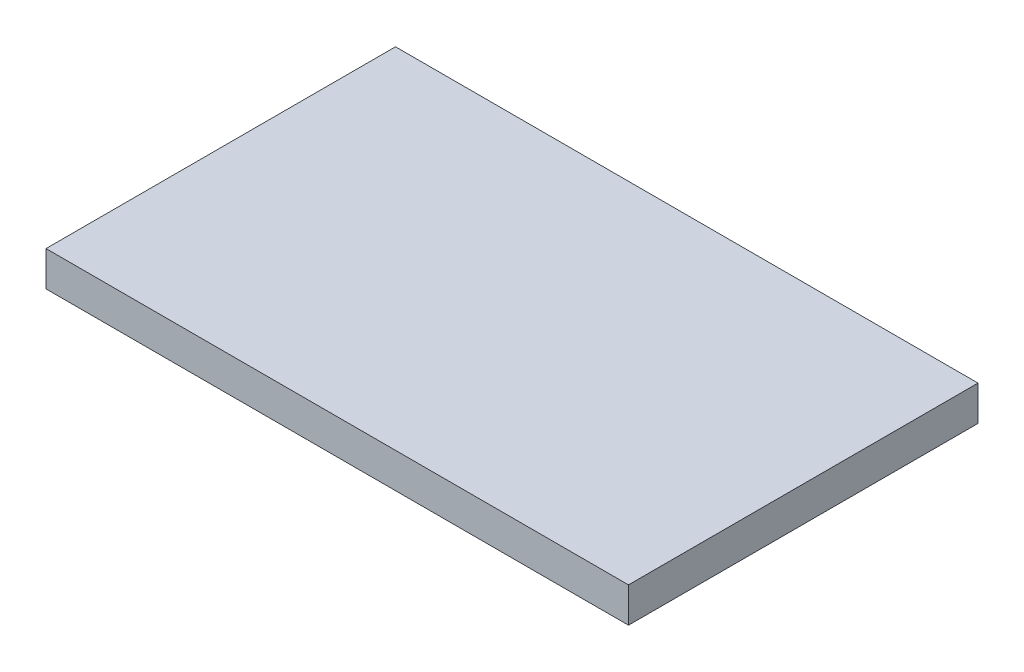
ISO-10303-21;
HEADER;
FILE_DESCRIPTION(('STEP AP214'),'2;1');
FILE_NAME('part.step','',(''),(''),'','','');
FILE_SCHEMA(('AUTOMOTIVE_DESIGN { 1 0 10303 214 1 1 1 1 }'));
ENDSEC;
DATA;
#1=APPLICATION_CONTEXT('core data for automotive mechanical design processes');
#2=APPLICATION_PROTOCOL_DEFINITION('international standard','automotive_design',2000,#1);
#3=PRODUCT_CONTEXT('',#1,'mechanical');
#4=PRODUCT('Part','Part','',(#3));
#5=PRODUCT_RELATED_PRODUCT_CATEGORY('part','',(#4));
#6=PRODUCT_DEFINITION_FORMATION('','',#4);
#7=PRODUCT_DEFINITION_CONTEXT('part definition',#1,'design');
#8=PRODUCT_DEFINITION('design','',#6,#7);
#9=PRODUCT_DEFINITION_SHAPE('','',#8);
#10=(LENGTH_UNIT() NAMED_UNIT(*) SI_UNIT(.MILLI.,.METRE.));
#11=(NAMED_UNIT(*) PLANE_ANGLE_UNIT() SI_UNIT($,.RADIAN.));
#12=(NAMED_UNIT(*) SI_UNIT($,.STERADIAN.) SOLID_ANGLE_UNIT());
#13=UNCERTAINTY_MEASURE_WITH_UNIT(LENGTH_MEASURE(1.E-05),#10,'distance_accuracy_value','');
#14=(GEOMETRIC_REPRESENTATION_CONTEXT(3) GLOBAL_UNCERTAINTY_ASSIGNED_CONTEXT((#13)) GLOBAL_UNIT_ASSIGNED_CONTEXT((#10,
#11,#12)) REPRESENTATION_CONTEXT('',''));
#15=CARTESIAN_POINT('',(0.,0.,0.));
#16=DIRECTION('',(0.,0.,1.));
#17=DIRECTION('',(1.,0.,0.));
#18=AXIS2_PLACEMENT_3D('',#15,#16,#17);
#19=CARTESIAN_POINT('',(25.,3.,15.));
#20=DIRECTION('',(-1.,0.,0.));
#21=DIRECTION('',(0.,0.,1.));
#22=AXIS2_PLACEMENT_3D('',#19,#20,#21);
#23=PLANE('',#22);
#24=DIRECTION('',(0.,0.,-1.));
#25=VECTOR('',#24,1.);
#26=CARTESIAN_POINT('',(25.,0.,15.));
#27=LINE('',#26,#25);
#28=CARTESIAN_POINT('',(25.,0.,15.));
#29=VERTEX_POINT('',#28);
#30=CARTESIAN_POINT('',(25.,0.,-15.));
#31=VERTEX_POINT('',#30);
#32=EDGE_CURVE('E113',#29,#31,#27,.T.);
#33=ORIENTED_EDGE('',*,*,#32,.T.);
#34=DIRECTION('',(0.,-1.,0.));
#35=VECTOR('',#34,1.);
#36=CARTESIAN_POINT('',(25.,3.,-15.));
#37=LINE('',#36,#35);
#38=CARTESIAN_POINT('',(25.,3.,-15.));
#39=VERTEX_POINT('',#38);
#40=EDGE_CURVE('E11',#39,#31,#37,.T.);
#41=ORIENTED_EDGE('',*,*,#40,.F.);
#42=DIRECTION('',(0.,0.,-1.));
#43=VECTOR('',#42,1.);
#44=CARTESIAN_POINT('',(25.,3.,15.));
#45=LINE('',#44,#43);
#46=CARTESIAN_POINT('',(25.,3.,15.));
#47=VERTEX_POINT('',#46);
#48=EDGE_CURVE('E97',#47,#39,#45,.T.);
#49=ORIENTED_EDGE('',*,*,#48,.F.);
#50=DIRECTION('',(0.,-1.,0.));
#51=VECTOR('',#50,1.);
#52=CARTESIAN_POINT('',(25.,3.,15.));
#53=LINE('',#52,#51);
#54=EDGE_CURVE('E109',#47,#29,#53,.T.);
#55=ORIENTED_EDGE('',*,*,#54,.T.);
#56=EDGE_LOOP('',(#33,#41,#49,#55));
#57=FACE_BOUND('',#56,.T.);
#58=ADVANCED_FACE('F45',(#57),#23,.F.);
#59=CARTESIAN_POINT('',(-25.,3.,-15.));
#60=DIRECTION('',(0.,0.,1.));
#61=DIRECTION('',(1.,0.,0.));
#62=AXIS2_PLACEMENT_3D('',#59,#60,#61);
#63=PLANE('',#62);
#64=DIRECTION('',(-1.,0.,0.));
#65=VECTOR('',#64,1.);
#66=CARTESIAN_POINT('',(-25.,0.,-15.));
#67=LINE('',#66,#65);
#68=CARTESIAN_POINT('',(-25.,0.,-15.));
#69=VERTEX_POINT('',#68);
#70=EDGE_CURVE('E102',#31,#69,#67,.T.);
#71=ORIENTED_EDGE('',*,*,#70,.T.);
#72=DIRECTION('',(0.,-1.,0.));
#73=VECTOR('',#72,1.);
#74=CARTESIAN_POINT('',(-25.,3.,-15.));
#75=LINE('',#74,#73);
#76=CARTESIAN_POINT('',(-25.,3.,-15.));
#77=VERTEX_POINT('',#76);
#78=EDGE_CURVE('E54',#77,#69,#75,.T.);
#79=ORIENTED_EDGE('',*,*,#78,.F.);
#80=DIRECTION('',(-1.,0.,0.));
#81=VECTOR('',#80,1.);
#82=CARTESIAN_POINT('',(-25.,3.,-15.));
#83=LINE('',#82,#81);
#84=EDGE_CURVE('E92',#39,#77,#83,.T.);
#85=ORIENTED_EDGE('',*,*,#84,.F.);
#86=ORIENTED_EDGE('',*,*,#40,.T.);
#87=EDGE_LOOP('',(#71,#79,#85,#86));
#88=FACE_BOUND('',#87,.T.);
#89=ADVANCED_FACE('F101',(#88),#63,.F.);
#90=CARTESIAN_POINT('',(-25.,3.,15.));
#91=DIRECTION('',(1.,0.,0.));
#92=DIRECTION('',(0.,0.,-1.));
#93=AXIS2_PLACEMENT_3D('',#90,#91,#92);
#94=PLANE('',#93);
#95=DIRECTION('',(0.,0.,1.));
#96=VECTOR('',#95,1.);
#97=CARTESIAN_POINT('',(-25.,0.,15.));
#98=LINE('',#97,#96);
#99=CARTESIAN_POINT('',(-25.,0.,15.));
#100=VERTEX_POINT('',#99);
#101=EDGE_CURVE('E79',#69,#100,#98,.T.);
#102=ORIENTED_EDGE('',*,*,#101,.T.);
#103=DIRECTION('',(0.,-1.,0.));
#104=VECTOR('',#103,1.);
#105=CARTESIAN_POINT('',(-25.,3.,15.));
#106=LINE('',#105,#104);
#107=CARTESIAN_POINT('',(-25.,3.,15.));
#108=VERTEX_POINT('',#107);
#109=EDGE_CURVE('E104',#108,#100,#106,.T.);
#110=ORIENTED_EDGE('',*,*,#109,.F.);
#111=DIRECTION('',(0.,0.,1.));
#112=VECTOR('',#111,1.);
#113=CARTESIAN_POINT('',(-25.,3.,15.));
#114=LINE('',#113,#112);
#115=EDGE_CURVE('E95',#77,#108,#114,.T.);
#116=ORIENTED_EDGE('',*,*,#115,.F.);
#117=ORIENTED_EDGE('',*,*,#78,.T.);
#118=EDGE_LOOP('',(#102,#110,#116,#117));
#119=FACE_BOUND('',#118,.T.);
#120=ADVANCED_FACE('F105',(#119),#94,.F.);
#121=CARTESIAN_POINT('',(-25.,3.,15.));
#122=DIRECTION('',(0.,0.,-1.));
#123=DIRECTION('',(-1.,0.,0.));
#124=AXIS2_PLACEMENT_3D('',#121,#122,#123);
#125=PLANE('',#124);
#126=DIRECTION('',(1.,0.,0.));
#127=VECTOR('',#126,1.);
#128=CARTESIAN_POINT('',(-25.,0.,15.));
#129=LINE('',#128,#127);
#130=EDGE_CURVE('E85',#100,#29,#129,.T.);
#131=ORIENTED_EDGE('',*,*,#130,.T.);
#132=ORIENTED_EDGE('',*,*,#54,.F.);
#133=DIRECTION('',(1.,0.,0.));
#134=VECTOR('',#133,1.);
#135=CARTESIAN_POINT('',(-25.,3.,15.));
#136=LINE('',#135,#134);
#137=EDGE_CURVE('E62',#108,#47,#136,.T.);
#138=ORIENTED_EDGE('',*,*,#137,.F.);
#139=ORIENTED_EDGE('',*,*,#109,.T.);
#140=EDGE_LOOP('',(#131,#132,#138,#139));
#141=FACE_BOUND('',#140,.T.);
#142=ADVANCED_FACE('F126',(#141),#125,.F.);
#143=CARTESIAN_POINT('',(0.,3.,0.));
#144=DIRECTION('',(0.,-1.,0.));
#145=DIRECTION('',(0.,0.,-1.));
#146=AXIS2_PLACEMENT_3D('',#143,#144,#145);
#147=PLANE('',#146);
#148=ORIENTED_EDGE('',*,*,#48,.T.);
#149=ORIENTED_EDGE('',*,*,#84,.T.);
#150=ORIENTED_EDGE('',*,*,#115,.T.);
#151=ORIENTED_EDGE('',*,*,#137,.T.);
#152=EDGE_LOOP('',(#148,#149,#150,#151));
#153=FACE_BOUND('',#152,.T.);
#154=ADVANCED_FACE('F93',(#153),#147,.F.);
#155=CARTESIAN_POINT('',(0.,0.,0.));
#156=DIRECTION('',(0.,-1.,0.));
#157=DIRECTION('',(0.,0.,-1.));
#158=AXIS2_PLACEMENT_3D('',#155,#156,#157);
#159=PLANE('',#158);
#160=ORIENTED_EDGE('',*,*,#32,.F.);
#161=ORIENTED_EDGE('',*,*,#130,.F.);
#162=ORIENTED_EDGE('',*,*,#101,.F.);
#163=ORIENTED_EDGE('',*,*,#70,.F.);
#164=EDGE_LOOP('',(#160,#161,#162,#163));
#165=FACE_BOUND('',#164,.T.);
#166=ADVANCED_FACE('F129',(#165),#159,.T.);
#167=CLOSED_SHELL('',(#58,#89,#120,#142,#154,#166));
#168=MANIFOLD_SOLID_BREP('B2',#167);
#169=ADVANCED_BREP_SHAPE_REPRESENTATION('',(#18,#168),#14);
#170=SHAPE_DEFINITION_REPRESENTATION(#9,#169);
ENDSEC;
END-ISO-10303-21;
